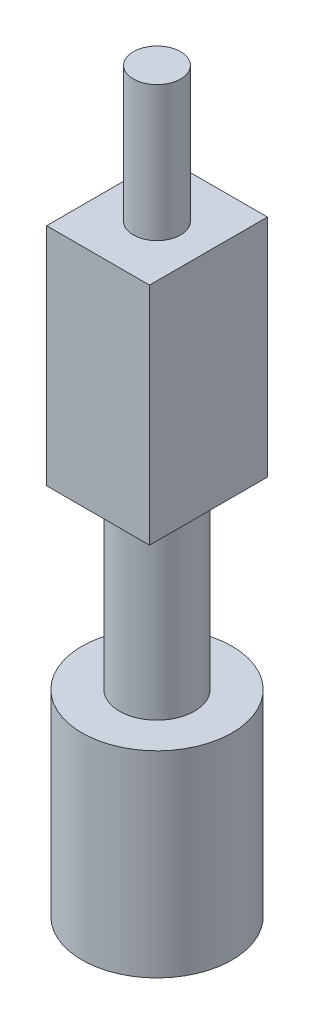
ISO-10303-21;
HEADER;
FILE_DESCRIPTION(('STEP AP214'),'2;1');
FILE_NAME('part.step','',(''),(''),'','','');
FILE_SCHEMA(('AUTOMOTIVE_DESIGN { 1 0 10303 214 1 1 1 1 }'));
ENDSEC;
DATA;
#1=APPLICATION_CONTEXT('core data for automotive mechanical design processes');
#2=APPLICATION_PROTOCOL_DEFINITION('international standard','automotive_design',2000,#1);
#3=PRODUCT_CONTEXT('',#1,'mechanical');
#4=PRODUCT('Part','Part','',(#3));
#5=PRODUCT_RELATED_PRODUCT_CATEGORY('part','',(#4));
#6=PRODUCT_DEFINITION_FORMATION('','',#4);
#7=PRODUCT_DEFINITION_CONTEXT('part definition',#1,'design');
#8=PRODUCT_DEFINITION('design','',#6,#7);
#9=PRODUCT_DEFINITION_SHAPE('','',#8);
#10=(LENGTH_UNIT() NAMED_UNIT(*) SI_UNIT(.MILLI.,.METRE.));
#11=(NAMED_UNIT(*) PLANE_ANGLE_UNIT() SI_UNIT($,.RADIAN.));
#12=(NAMED_UNIT(*) SI_UNIT($,.STERADIAN.) SOLID_ANGLE_UNIT());
#13=UNCERTAINTY_MEASURE_WITH_UNIT(LENGTH_MEASURE(1.E-05),#10,'distance_accuracy_value','');
#14=(GEOMETRIC_REPRESENTATION_CONTEXT(3) GLOBAL_UNCERTAINTY_ASSIGNED_CONTEXT((#13)) GLOBAL_UNIT_ASSIGNED_CONTEXT((#10,
#11,#12)) REPRESENTATION_CONTEXT('',''));
#15=CARTESIAN_POINT('',(0.,0.,0.));
#16=DIRECTION('',(0.,0.,1.));
#17=DIRECTION('',(1.,0.,0.));
#18=AXIS2_PLACEMENT_3D('',#15,#16,#17);
#19=CARTESIAN_POINT('',(6.85,30.,7.85));
#20=DIRECTION('',(-1.,0.,0.));
#21=DIRECTION('',(0.,0.,1.));
#22=AXIS2_PLACEMENT_3D('',#19,#20,#21);
#23=PLANE('',#22);
#24=DIRECTION('',(0.,0.,-1.));
#25=VECTOR('',#24,1.);
#26=CARTESIAN_POINT('',(6.85,0.,7.85));
#27=LINE('',#26,#25);
#28=CARTESIAN_POINT('',(6.85,0.,7.85));
#29=VERTEX_POINT('',#28);
#30=CARTESIAN_POINT('',(6.85,0.,-7.85));
#31=VERTEX_POINT('',#30);
#32=EDGE_CURVE('E111',#29,#31,#27,.T.);
#33=ORIENTED_EDGE('',*,*,#32,.T.);
#34=DIRECTION('',(0.,-1.,0.));
#35=VECTOR('',#34,1.);
#36=CARTESIAN_POINT('',(6.85,30.,-7.85));
#37=LINE('',#36,#35);
#38=CARTESIAN_POINT('',(6.85,30.,-7.85));
#39=VERTEX_POINT('',#38);
#40=EDGE_CURVE('E42',#39,#31,#37,.T.);
#41=ORIENTED_EDGE('',*,*,#40,.F.);
#42=DIRECTION('',(0.,0.,-1.));
#43=VECTOR('',#42,1.);
#44=CARTESIAN_POINT('',(6.85,30.,7.85));
#45=LINE('',#44,#43);
#46=CARTESIAN_POINT('',(6.85,30.,7.85));
#47=VERTEX_POINT('',#46);
#48=EDGE_CURVE('E94',#47,#39,#45,.T.);
#49=ORIENTED_EDGE('',*,*,#48,.F.);
#50=DIRECTION('',(0.,-1.,0.));
#51=VECTOR('',#50,1.);
#52=CARTESIAN_POINT('',(6.85,30.,7.85));
#53=LINE('',#52,#51);
#54=EDGE_CURVE('E107',#47,#29,#53,.T.);
#55=ORIENTED_EDGE('',*,*,#54,.T.);
#56=EDGE_LOOP('',(#33,#41,#49,#55));
#57=FACE_BOUND('',#56,.T.);
#58=ADVANCED_FACE('F39',(#57),#23,.F.);
#59=CARTESIAN_POINT('',(-6.85,30.,-7.85));
#60=DIRECTION('',(0.,0.,1.));
#61=DIRECTION('',(1.,0.,0.));
#62=AXIS2_PLACEMENT_3D('',#59,#60,#61);
#63=PLANE('',#62);
#64=CARTESIAN_POINT('',(0.,8.,-7.85));
#65=DIRECTION('',(0.,0.,-1.));
#66=DIRECTION('',(-1.,0.,0.));
#67=AXIS2_PLACEMENT_3D('',#64,#65,#66);
#68=CIRCLE('',#67,1.5);
#69=CARTESIAN_POINT('',(-1.5,8.,-7.85));
#70=VERTEX_POINT('',#69);
#71=EDGE_CURVE('E167',#70,#70,#68,.T.);
#72=ORIENTED_EDGE('',*,*,#71,.F.);
#73=EDGE_LOOP('',(#72));
#74=FACE_BOUND('',#73,.T.);
#75=CARTESIAN_POINT('',(0.,22.8,-7.85));
#76=DIRECTION('',(0.,0.,-1.));
#77=DIRECTION('',(-1.,0.,0.));
#78=AXIS2_PLACEMENT_3D('',#75,#76,#77);
#79=CIRCLE('',#78,1.5);
#80=CARTESIAN_POINT('',(-1.5,22.8,-7.85));
#81=VERTEX_POINT('',#80);
#82=EDGE_CURVE('E159',#81,#81,#79,.T.);
#83=ORIENTED_EDGE('',*,*,#82,.F.);
#84=EDGE_LOOP('',(#83));
#85=FACE_BOUND('',#84,.T.);
#86=DIRECTION('',(-1.,0.,0.));
#87=VECTOR('',#86,1.);
#88=CARTESIAN_POINT('',(-6.85,0.,-7.85));
#89=LINE('',#88,#87);
#90=CARTESIAN_POINT('',(-6.85,0.,-7.85));
#91=VERTEX_POINT('',#90);
#92=EDGE_CURVE('E100',#31,#91,#89,.T.);
#93=ORIENTED_EDGE('',*,*,#92,.T.);
#94=DIRECTION('',(0.,-1.,0.));
#95=VECTOR('',#94,1.);
#96=CARTESIAN_POINT('',(-6.85,30.,-7.85));
#97=LINE('',#96,#95);
#98=CARTESIAN_POINT('',(-6.85,30.,-7.85));
#99=VERTEX_POINT('',#98);
#100=EDGE_CURVE('E98',#99,#91,#97,.T.);
#101=ORIENTED_EDGE('',*,*,#100,.F.);
#102=DIRECTION('',(-1.,0.,0.));
#103=VECTOR('',#102,1.);
#104=CARTESIAN_POINT('',(-6.85,30.,-7.85));
#105=LINE('',#104,#103);
#106=EDGE_CURVE('E89',#39,#99,#105,.T.);
#107=ORIENTED_EDGE('',*,*,#106,.F.);
#108=ORIENTED_EDGE('',*,*,#40,.T.);
#109=EDGE_LOOP('',(#93,#101,#107,#108));
#110=FACE_BOUND('',#109,.T.);
#111=ADVANCED_FACE('F99',(#74,#85,#110),#63,.F.);
#112=CARTESIAN_POINT('',(-6.85,30.,7.85));
#113=DIRECTION('',(1.,0.,0.));
#114=DIRECTION('',(0.,0.,-1.));
#115=AXIS2_PLACEMENT_3D('',#112,#113,#114);
#116=PLANE('',#115);
#117=DIRECTION('',(0.,0.,1.));
#118=VECTOR('',#117,1.);
#119=CARTESIAN_POINT('',(-6.85,0.,7.85));
#120=LINE('',#119,#118);
#121=CARTESIAN_POINT('',(-6.85,0.,7.85));
#122=VERTEX_POINT('',#121);
#123=EDGE_CURVE('E75',#91,#122,#120,.T.);
#124=ORIENTED_EDGE('',*,*,#123,.T.);
#125=DIRECTION('',(0.,-1.,0.));
#126=VECTOR('',#125,1.);
#127=CARTESIAN_POINT('',(-6.85,30.,7.85));
#128=LINE('',#127,#126);
#129=CARTESIAN_POINT('',(-6.85,30.,7.85));
#130=VERTEX_POINT('',#129);
#131=EDGE_CURVE('E102',#130,#122,#128,.T.);
#132=ORIENTED_EDGE('',*,*,#131,.F.);
#133=DIRECTION('',(0.,0.,1.));
#134=VECTOR('',#133,1.);
#135=CARTESIAN_POINT('',(-6.85,30.,7.85));
#136=LINE('',#135,#134);
#137=EDGE_CURVE('E92',#99,#130,#136,.T.);
#138=ORIENTED_EDGE('',*,*,#137,.F.);
#139=ORIENTED_EDGE('',*,*,#100,.T.);
#140=EDGE_LOOP('',(#124,#132,#138,#139));
#141=FACE_BOUND('',#140,.T.);
#142=ADVANCED_FACE('F103',(#141),#116,.F.);
#143=CARTESIAN_POINT('',(-6.85,30.,7.85));
#144=DIRECTION('',(0.,0.,-1.));
#145=DIRECTION('',(-1.,0.,0.));
#146=AXIS2_PLACEMENT_3D('',#143,#144,#145);
#147=PLANE('',#146);
#148=DIRECTION('',(1.,0.,0.));
#149=VECTOR('',#148,1.);
#150=CARTESIAN_POINT('',(-6.85,0.,7.85));
#151=LINE('',#150,#149);
#152=EDGE_CURVE('E81',#122,#29,#151,.T.);
#153=ORIENTED_EDGE('',*,*,#152,.T.);
#154=ORIENTED_EDGE('',*,*,#54,.F.);
#155=DIRECTION('',(1.,0.,0.));
#156=VECTOR('',#155,1.);
#157=CARTESIAN_POINT('',(-6.85,30.,7.85));
#158=LINE('',#157,#156);
#159=EDGE_CURVE('E58',#130,#47,#158,.T.);
#160=ORIENTED_EDGE('',*,*,#159,.F.);
#161=ORIENTED_EDGE('',*,*,#131,.T.);
#162=EDGE_LOOP('',(#153,#154,#160,#161));
#163=FACE_BOUND('',#162,.T.);
#164=ADVANCED_FACE('F125',(#163),#147,.F.);
#165=CARTESIAN_POINT('',(0.,30.,0.));
#166=DIRECTION('',(0.,-1.,0.));
#167=DIRECTION('',(0.,0.,-1.));
#168=AXIS2_PLACEMENT_3D('',#165,#166,#167);
#169=PLANE('',#168);
#170=CARTESIAN_POINT('',(0.,30.,0.));
#171=DIRECTION('',(0.,1.,0.));
#172=DIRECTION('',(0.,0.,1.));
#173=AXIS2_PLACEMENT_3D('',#170,#171,#172);
#174=CIRCLE('',#173,3.15);
#175=CARTESIAN_POINT('',(0.,30.,3.15));
#176=VERTEX_POINT('',#175);
#177=EDGE_CURVE('E11',#176,#176,#174,.T.);
#178=ORIENTED_EDGE('',*,*,#177,.F.);
#179=EDGE_LOOP('',(#178));
#180=FACE_BOUND('',#179,.T.);
#181=ORIENTED_EDGE('',*,*,#48,.T.);
#182=ORIENTED_EDGE('',*,*,#106,.T.);
#183=ORIENTED_EDGE('',*,*,#137,.T.);
#184=ORIENTED_EDGE('',*,*,#159,.T.);
#185=EDGE_LOOP('',(#181,#182,#183,#184));
#186=FACE_BOUND('',#185,.T.);
#187=ADVANCED_FACE('F90',(#180,#186),#169,.F.);
#188=CARTESIAN_POINT('',(0.,0.,0.));
#189=DIRECTION('',(0.,-1.,0.));
#190=DIRECTION('',(0.,0.,-1.));
#191=AXIS2_PLACEMENT_3D('',#188,#189,#190);
#192=PLANE('',#191);
#193=CARTESIAN_POINT('',(0.,0.,0.));
#194=DIRECTION('',(0.,-1.,0.));
#195=DIRECTION('',(0.,0.,-1.));
#196=AXIS2_PLACEMENT_3D('',#193,#194,#195);
#197=CIRCLE('',#196,5.);
#198=CARTESIAN_POINT('',(0.,0.,-5.));
#199=VERTEX_POINT('',#198);
#200=EDGE_CURVE('E132',#199,#199,#197,.T.);
#201=ORIENTED_EDGE('',*,*,#200,.F.);
#202=EDGE_LOOP('',(#201));
#203=FACE_BOUND('',#202,.T.);
#204=ORIENTED_EDGE('',*,*,#32,.F.);
#205=ORIENTED_EDGE('',*,*,#152,.F.);
#206=ORIENTED_EDGE('',*,*,#123,.F.);
#207=ORIENTED_EDGE('',*,*,#92,.F.);
#208=EDGE_LOOP('',(#204,#205,#206,#207));
#209=FACE_BOUND('',#208,.T.);
#210=ADVANCED_FACE('F128',(#203,#209),#192,.T.);
#211=CARTESIAN_POINT('',(0.,-24.,0.));
#212=DIRECTION('',(0.,1.,0.));
#213=DIRECTION('',(0.,0.,1.));
#214=AXIS2_PLACEMENT_3D('',#211,#212,#213);
#215=CYLINDRICAL_SURFACE('',#214,5.);
#216=CARTESIAN_POINT('',(0.,-24.,0.));
#217=DIRECTION('',(0.,-1.,0.));
#218=DIRECTION('',(0.,0.,-1.));
#219=AXIS2_PLACEMENT_3D('',#216,#217,#218);
#220=CIRCLE('',#219,5.);
#221=CARTESIAN_POINT('',(0.,-24.,-5.));
#222=VERTEX_POINT('',#221);
#223=EDGE_CURVE('E115',#222,#222,#220,.T.);
#224=ORIENTED_EDGE('',*,*,#223,.F.);
#225=EDGE_LOOP('',(#224));
#226=FACE_BOUND('',#225,.T.);
#227=ORIENTED_EDGE('',*,*,#200,.T.);
#228=EDGE_LOOP('',(#227));
#229=FACE_BOUND('',#228,.T.);
#230=ADVANCED_FACE('F238',(#226,#229),#215,.T.);
#231=CARTESIAN_POINT('',(0.,-50.2,0.));
#232=DIRECTION('',(0.,1.,0.));
#233=DIRECTION('',(0.,0.,1.));
#234=AXIS2_PLACEMENT_3D('',#231,#232,#233);
#235=CYLINDRICAL_SURFACE('',#234,10.);
#236=CARTESIAN_POINT('',(0.,-50.2,0.));
#237=DIRECTION('',(0.,-1.,0.));
#238=DIRECTION('',(0.,0.,-1.));
#239=AXIS2_PLACEMENT_3D('',#236,#237,#238);
#240=CIRCLE('',#239,10.);
#241=CARTESIAN_POINT('',(0.,-50.2,-10.));
#242=VERTEX_POINT('',#241);
#243=EDGE_CURVE('E139',#242,#242,#240,.T.);
#244=ORIENTED_EDGE('',*,*,#243,.F.);
#245=EDGE_LOOP('',(#244));
#246=FACE_BOUND('',#245,.T.);
#247=CARTESIAN_POINT('',(0.,-24.,0.));
#248=DIRECTION('',(0.,-1.,0.));
#249=DIRECTION('',(0.,0.,-1.));
#250=AXIS2_PLACEMENT_3D('',#247,#248,#249);
#251=CIRCLE('',#250,10.);
#252=CARTESIAN_POINT('',(0.,-24.,-10.));
#253=VERTEX_POINT('',#252);
#254=EDGE_CURVE('E140',#253,#253,#251,.T.);
#255=ORIENTED_EDGE('',*,*,#254,.T.);
#256=EDGE_LOOP('',(#255));
#257=FACE_BOUND('',#256,.T.);
#258=ADVANCED_FACE('F246',(#246,#257),#235,.T.);
#259=CARTESIAN_POINT('',(0.,-50.2,0.));
#260=DIRECTION('',(0.,-1.,0.));
#261=DIRECTION('',(0.,0.,-1.));
#262=AXIS2_PLACEMENT_3D('',#259,#260,#261);
#263=PLANE('',#262);
#264=CARTESIAN_POINT('',(0.,-50.2,0.));
#265=DIRECTION('',(0.,-1.,0.));
#266=DIRECTION('',(0.,0.,-1.));
#267=AXIS2_PLACEMENT_3D('',#264,#265,#266);
#268=CIRCLE('',#267,5.);
#269=CARTESIAN_POINT('',(0.,-50.2,-5.));
#270=VERTEX_POINT('',#269);
#271=EDGE_CURVE('E49',#270,#270,#268,.T.);
#272=ORIENTED_EDGE('',*,*,#271,.F.);
#273=EDGE_LOOP('',(#272));
#274=FACE_BOUND('',#273,.T.);
#275=ORIENTED_EDGE('',*,*,#243,.T.);
#276=EDGE_LOOP('',(#275));
#277=FACE_BOUND('',#276,.T.);
#278=ADVANCED_FACE('F254',(#274,#277),#263,.T.);
#279=CARTESIAN_POINT('',(0.,-24.,0.));
#280=DIRECTION('',(0.,-1.,0.));
#281=DIRECTION('',(0.,0.,-1.));
#282=AXIS2_PLACEMENT_3D('',#279,#280,#281);
#283=PLANE('',#282);
#284=ORIENTED_EDGE('',*,*,#223,.T.);
#285=EDGE_LOOP('',(#284));
#286=FACE_BOUND('',#285,.T.);
#287=ORIENTED_EDGE('',*,*,#254,.F.);
#288=EDGE_LOOP('',(#287));
#289=FACE_BOUND('',#288,.T.);
#290=ADVANCED_FACE('F263',(#286,#289),#283,.F.);
#291=CARTESIAN_POINT('',(0.,-53.2,0.));
#292=DIRECTION('',(0.,1.,0.));
#293=DIRECTION('',(0.,0.,1.));
#294=AXIS2_PLACEMENT_3D('',#291,#292,#293);
#295=CYLINDRICAL_SURFACE('',#294,5.);
#296=CARTESIAN_POINT('',(0.,-53.2,0.));
#297=DIRECTION('',(0.,-1.,0.));
#298=DIRECTION('',(0.,0.,-1.));
#299=AXIS2_PLACEMENT_3D('',#296,#297,#298);
#300=CIRCLE('',#299,5.);
#301=CARTESIAN_POINT('',(0.,-53.2,-5.));
#302=VERTEX_POINT('',#301);
#303=EDGE_CURVE('E144',#302,#302,#300,.T.);
#304=ORIENTED_EDGE('',*,*,#303,.F.);
#305=EDGE_LOOP('',(#304));
#306=FACE_BOUND('',#305,.T.);
#307=ORIENTED_EDGE('',*,*,#271,.T.);
#308=EDGE_LOOP('',(#307));
#309=FACE_BOUND('',#308,.T.);
#310=ADVANCED_FACE('F271',(#306,#309),#295,.T.);
#311=CARTESIAN_POINT('',(0.,-53.2,0.));
#312=DIRECTION('',(0.,-1.,0.));
#313=DIRECTION('',(0.,0.,-1.));
#314=AXIS2_PLACEMENT_3D('',#311,#312,#313);
#315=PLANE('',#314);
#316=ORIENTED_EDGE('',*,*,#303,.T.);
#317=EDGE_LOOP('',(#316));
#318=FACE_BOUND('',#317,.T.);
#319=ADVANCED_FACE('F278',(#318),#315,.T.);
#320=CARTESIAN_POINT('',(0.,48.,0.));
#321=DIRECTION('',(0.,-1.,0.));
#322=DIRECTION('',(0.,0.,-1.));
#323=AXIS2_PLACEMENT_3D('',#320,#321,#322);
#324=CYLINDRICAL_SURFACE('',#323,3.15);
#325=CARTESIAN_POINT('',(0.,48.,0.));
#326=DIRECTION('',(0.,1.,0.));
#327=DIRECTION('',(0.,0.,1.));
#328=AXIS2_PLACEMENT_3D('',#325,#326,#327);
#329=CIRCLE('',#328,3.15);
#330=CARTESIAN_POINT('',(0.,48.,3.15));
#331=VERTEX_POINT('',#330);
#332=EDGE_CURVE('E153',#331,#331,#329,.T.);
#333=ORIENTED_EDGE('',*,*,#332,.F.);
#334=EDGE_LOOP('',(#333));
#335=FACE_BOUND('',#334,.T.);
#336=ORIENTED_EDGE('',*,*,#177,.T.);
#337=EDGE_LOOP('',(#336));
#338=FACE_BOUND('',#337,.T.);
#339=ADVANCED_FACE('F199',(#335,#338),#324,.T.);
#340=CARTESIAN_POINT('',(0.,48.,0.));
#341=DIRECTION('',(0.,1.,0.));
#342=DIRECTION('',(0.,0.,1.));
#343=AXIS2_PLACEMENT_3D('',#340,#341,#342);
#344=PLANE('',#343);
#345=ORIENTED_EDGE('',*,*,#332,.T.);
#346=EDGE_LOOP('',(#345));
#347=FACE_BOUND('',#346,.T.);
#348=ADVANCED_FACE('F190',(#347),#344,.T.);
#349=CARTESIAN_POINT('',(0.,22.8,-5.85));
#350=DIRECTION('',(0.,0.,-1.));
#351=DIRECTION('',(-1.,0.,0.));
#352=AXIS2_PLACEMENT_3D('',#349,#350,#351);
#353=CYLINDRICAL_SURFACE('',#352,1.5);
#354=CARTESIAN_POINT('',(0.,22.8,-5.85));
#355=DIRECTION('',(0.,0.,-1.));
#356=DIRECTION('',(-1.,0.,0.));
#357=AXIS2_PLACEMENT_3D('',#354,#355,#356);
#358=CIRCLE('',#357,1.5);
#359=CARTESIAN_POINT('',(-1.5,22.8,-5.85));
#360=VERTEX_POINT('',#359);
#361=EDGE_CURVE('E163',#360,#360,#358,.T.);
#362=ORIENTED_EDGE('',*,*,#361,.F.);
#363=EDGE_LOOP('',(#362));
#364=FACE_BOUND('',#363,.T.);
#365=ORIENTED_EDGE('',*,*,#82,.T.);
#366=EDGE_LOOP('',(#365));
#367=FACE_BOUND('',#366,.T.);
#368=ADVANCED_FACE('F188',(#364,#367),#353,.F.);
#369=CARTESIAN_POINT('',(0.,22.8,-5.85));
#370=DIRECTION('',(0.,0.,-1.));
#371=DIRECTION('',(-1.,0.,0.));
#372=AXIS2_PLACEMENT_3D('',#369,#370,#371);
#373=PLANE('',#372);
#374=ORIENTED_EDGE('',*,*,#361,.T.);
#375=EDGE_LOOP('',(#374));
#376=FACE_BOUND('',#375,.T.);
#377=ADVANCED_FACE('F180',(#376),#373,.T.);
#378=CARTESIAN_POINT('',(0.,8.,-5.85));
#379=DIRECTION('',(0.,0.,-1.));
#380=DIRECTION('',(-1.,0.,0.));
#381=AXIS2_PLACEMENT_3D('',#378,#379,#380);
#382=CYLINDRICAL_SURFACE('',#381,1.5);
#383=CARTESIAN_POINT('',(0.,8.,-5.85));
#384=DIRECTION('',(0.,0.,-1.));
#385=DIRECTION('',(-1.,0.,0.));
#386=AXIS2_PLACEMENT_3D('',#383,#384,#385);
#387=CIRCLE('',#386,1.5);
#388=CARTESIAN_POINT('',(-1.5,8.,-5.85));
#389=VERTEX_POINT('',#388);
#390=EDGE_CURVE('E158',#389,#389,#387,.T.);
#391=ORIENTED_EDGE('',*,*,#390,.F.);
#392=EDGE_LOOP('',(#391));
#393=FACE_BOUND('',#392,.T.);
#394=ORIENTED_EDGE('',*,*,#71,.T.);
#395=EDGE_LOOP('',(#394));
#396=FACE_BOUND('',#395,.T.);
#397=ADVANCED_FACE('F177',(#393,#396),#382,.F.);
#398=CARTESIAN_POINT('',(0.,8.,-5.85));
#399=DIRECTION('',(0.,0.,-1.));
#400=DIRECTION('',(-1.,0.,0.));
#401=AXIS2_PLACEMENT_3D('',#398,#399,#400);
#402=PLANE('',#401);
#403=ORIENTED_EDGE('',*,*,#390,.T.);
#404=EDGE_LOOP('',(#403));
#405=FACE_BOUND('',#404,.T.);
#406=ADVANCED_FACE('F175',(#405),#402,.T.);
#407=CLOSED_SHELL('',(#58,#111,#142,#164,#187,#210,#230,#258,#278,#290,#310,#319,#339,#348,#368,
#377,#397,#406));
#408=MANIFOLD_SOLID_BREP('B2',#407);
#409=ADVANCED_BREP_SHAPE_REPRESENTATION('',(#18,#408),#14);
#410=SHAPE_DEFINITION_REPRESENTATION(#9,#409);
ENDSEC;
END-ISO-10303-21;
